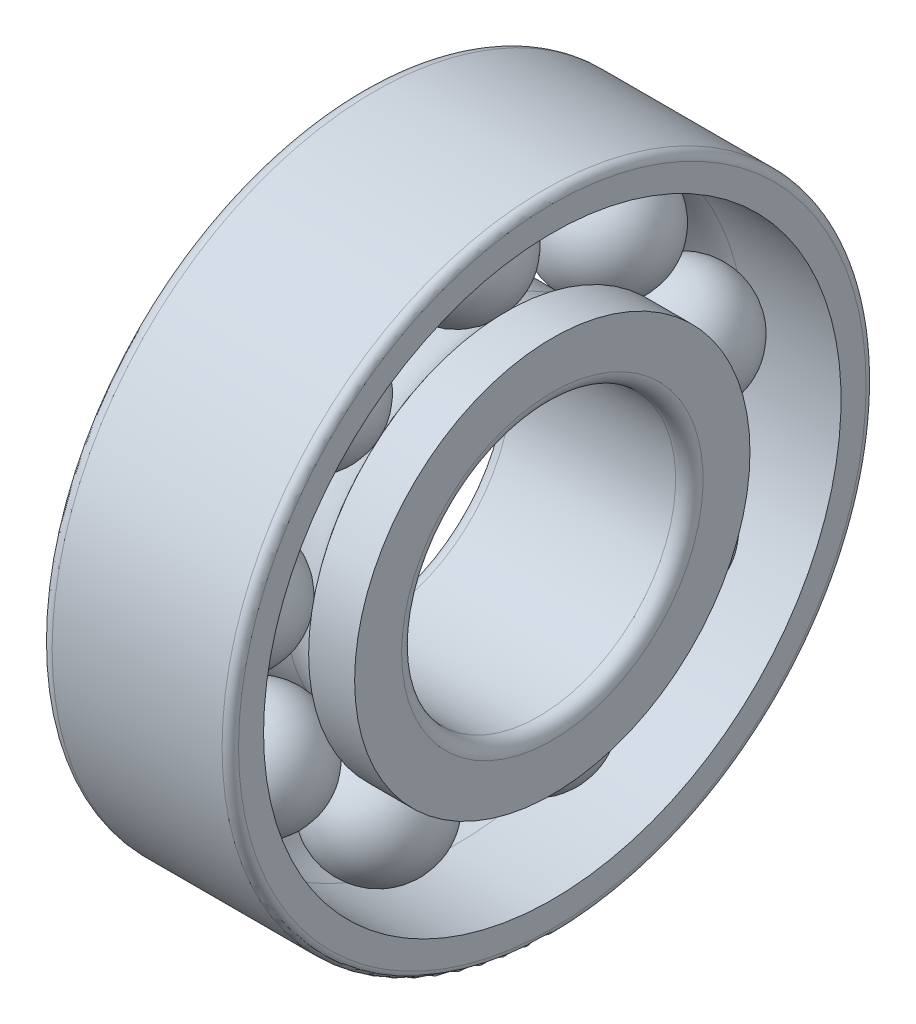
ISO-10303-21;
HEADER;
FILE_DESCRIPTION(('STEP AP214'),'2;1');
FILE_NAME('part.step','',(''),(''),'','','');
FILE_SCHEMA(('AUTOMOTIVE_DESIGN { 1 0 10303 214 1 1 1 1 }'));
ENDSEC;
DATA;
#1=APPLICATION_CONTEXT('core data for automotive mechanical design processes');
#2=APPLICATION_PROTOCOL_DEFINITION('international standard','automotive_design',2000,#1);
#3=PRODUCT_CONTEXT('',#1,'mechanical');
#4=PRODUCT('Part','Part','',(#3));
#5=PRODUCT_RELATED_PRODUCT_CATEGORY('part','',(#4));
#6=PRODUCT_DEFINITION_FORMATION('','',#4);
#7=PRODUCT_DEFINITION_CONTEXT('part definition',#1,'design');
#8=PRODUCT_DEFINITION('design','',#6,#7);
#9=PRODUCT_DEFINITION_SHAPE('','',#8);
#10=(LENGTH_UNIT() NAMED_UNIT(*) SI_UNIT(.MILLI.,.METRE.));
#11=(NAMED_UNIT(*) PLANE_ANGLE_UNIT() SI_UNIT($,.RADIAN.));
#12=(NAMED_UNIT(*) SI_UNIT($,.STERADIAN.) SOLID_ANGLE_UNIT());
#13=UNCERTAINTY_MEASURE_WITH_UNIT(LENGTH_MEASURE(1.E-05),#10,'distance_accuracy_value','');
#14=(GEOMETRIC_REPRESENTATION_CONTEXT(3) GLOBAL_UNCERTAINTY_ASSIGNED_CONTEXT((#13)) GLOBAL_UNIT_ASSIGNED_CONTEXT((#10,
#11,#12)) REPRESENTATION_CONTEXT('',''));
#15=CARTESIAN_POINT('',(0.,0.,0.));
#16=DIRECTION('',(0.,0.,1.));
#17=DIRECTION('',(1.,0.,0.));
#18=AXIS2_PLACEMENT_3D('',#15,#16,#17);
#19=CARTESIAN_POINT('',(-7.00000000000001,23.5,0.));
#20=DIRECTION('',(1.,0.,0.));
#21=DIRECTION('',(0.,0.,-1.));
#22=AXIS2_PLACEMENT_3D('',#19,#20,#21);
#23=PLANE('',#22);
#24=CARTESIAN_POINT('',(-7.00000000000001,0.,0.));
#25=DIRECTION('',(1.,0.,0.));
#26=DIRECTION('',(0.,0.,-1.));
#27=AXIS2_PLACEMENT_3D('',#24,#25,#26);
#28=CIRCLE('',#27,22.5);
#29=CARTESIAN_POINT('',(-7.00000000000001,0.,-22.5));
#30=VERTEX_POINT('',#29);
#31=EDGE_CURVE('P0_E20',#30,#30,#28,.F.);
#32=ORIENTED_EDGE('',*,*,#31,.T.);
#33=EDGE_LOOP('',(#32));
#34=FACE_BOUND('',#33,.T.);
#35=CARTESIAN_POINT('',(-7.00000000000001,0.,0.));
#36=DIRECTION('',(-1.,0.,0.));
#37=DIRECTION('',(0.,0.,1.));
#38=AXIS2_PLACEMENT_3D('',#35,#36,#37);
#39=CIRCLE('',#38,19.074);
#40=CARTESIAN_POINT('',(-7.00000000000001,0.,19.074));
#41=VERTEX_POINT('',#40);
#42=EDGE_CURVE('P0_E33',#41,#41,#39,.T.);
#43=ORIENTED_EDGE('',*,*,#42,.F.);
#44=EDGE_LOOP('',(#43));
#45=FACE_BOUND('',#44,.T.);
#46=ADVANCED_FACE('P0_F14',(#34,#45),#23,.F.);
#47=CARTESIAN_POINT('',(0.,0.,0.));
#48=DIRECTION('',(-1.,0.,0.));
#49=DIRECTION('',(0.,0.,1.));
#50=AXIS2_PLACEMENT_3D('',#47,#48,#49);
#51=CYLINDRICAL_SURFACE('',#50,19.074);
#52=CARTESIAN_POINT('',(-3.64399615806603,0.,0.));
#53=DIRECTION('',(-1.,0.,0.));
#54=DIRECTION('',(0.,0.,1.));
#55=AXIS2_PLACEMENT_3D('',#52,#53,#54);
#56=CIRCLE('',#55,19.074);
#57=CARTESIAN_POINT('',(-3.64399615806603,0.,19.074));
#58=VERTEX_POINT('',#57);
#59=EDGE_CURVE('P0_E36',#58,#58,#56,.T.);
#60=ORIENTED_EDGE('',*,*,#59,.F.);
#61=EDGE_LOOP('',(#60));
#62=FACE_BOUND('',#61,.T.);
#63=ORIENTED_EDGE('',*,*,#42,.T.);
#64=EDGE_LOOP('',(#63));
#65=FACE_BOUND('',#64,.T.);
#66=ADVANCED_FACE('P0_F57',(#62,#65),#51,.F.);
#67=CARTESIAN_POINT('',(0.,0.,0.));
#68=DIRECTION('',(-1.,0.,0.));
#69=DIRECTION('',(0.,0.,1.));
#70=AXIS2_PLACEMENT_3D('',#67,#68,#69);
#71=TOROIDAL_SURFACE('',#70,16.75,4.322);
#72=CARTESIAN_POINT('',(0.,0.,0.));
#73=DIRECTION('',(-1.,0.,0.));
#74=DIRECTION('',(0.,0.,1.));
#75=AXIS2_PLACEMENT_3D('',#72,#73,#74);
#76=CIRCLE('',#75,21.072);
#77=CARTESIAN_POINT('',(0.,0.,21.072));
#78=VERTEX_POINT('',#77);
#79=EDGE_CURVE('P0_E39',#78,#78,#76,.T.);
#80=ORIENTED_EDGE('',*,*,#79,.F.);
#81=EDGE_LOOP('',(#80));
#82=FACE_BOUND('',#81,.T.);
#83=ORIENTED_EDGE('',*,*,#59,.T.);
#84=EDGE_LOOP('',(#83));
#85=FACE_BOUND('',#84,.T.);
#86=ADVANCED_FACE('P0_F51',(#82,#85),#71,.F.);
#87=CARTESIAN_POINT('',(0.,0.,0.));
#88=DIRECTION('',(-1.,0.,0.));
#89=DIRECTION('',(0.,0.,1.));
#90=AXIS2_PLACEMENT_3D('',#87,#88,#89);
#91=CYLINDRICAL_SURFACE('',#90,21.072);
#92=CARTESIAN_POINT('',(7.00000000000001,0.,0.));
#93=DIRECTION('',(-1.,0.,0.));
#94=DIRECTION('',(0.,0.,1.));
#95=AXIS2_PLACEMENT_3D('',#92,#93,#94);
#96=CIRCLE('',#95,21.072);
#97=CARTESIAN_POINT('',(7.00000000000001,0.,21.072));
#98=VERTEX_POINT('',#97);
#99=EDGE_CURVE('P0_E42',#98,#98,#96,.T.);
#100=ORIENTED_EDGE('',*,*,#99,.F.);
#101=EDGE_LOOP('',(#100));
#102=FACE_BOUND('',#101,.T.);
#103=ORIENTED_EDGE('',*,*,#79,.T.);
#104=EDGE_LOOP('',(#103));
#105=FACE_BOUND('',#104,.T.);
#106=ADVANCED_FACE('P0_F48',(#102,#105),#91,.F.);
#107=CARTESIAN_POINT('',(7.00000000000001,23.5,0.));
#108=DIRECTION('',(-1.,0.,0.));
#109=DIRECTION('',(0.,0.,1.));
#110=AXIS2_PLACEMENT_3D('',#107,#108,#109);
#111=PLANE('',#110);
#112=CARTESIAN_POINT('',(7.00000000000001,0.,0.));
#113=DIRECTION('',(-1.,0.,0.));
#114=DIRECTION('',(0.,0.,1.));
#115=AXIS2_PLACEMENT_3D('',#112,#113,#114);
#116=CIRCLE('',#115,22.9);
#117=CARTESIAN_POINT('',(7.00000000000001,0.,22.9));
#118=VERTEX_POINT('',#117);
#119=EDGE_CURVE('P0_E24',#118,#118,#116,.F.);
#120=ORIENTED_EDGE('',*,*,#119,.T.);
#121=EDGE_LOOP('',(#120));
#122=FACE_BOUND('',#121,.T.);
#123=ORIENTED_EDGE('',*,*,#99,.T.);
#124=EDGE_LOOP('',(#123));
#125=FACE_BOUND('',#124,.T.);
#126=ADVANCED_FACE('P0_F46',(#122,#125),#111,.F.);
#127=CARTESIAN_POINT('',(0.,0.,0.));
#128=DIRECTION('',(-1.,0.,0.));
#129=DIRECTION('',(0.,0.,1.));
#130=AXIS2_PLACEMENT_3D('',#127,#128,#129);
#131=CYLINDRICAL_SURFACE('',#130,23.5);
#132=CARTESIAN_POINT('',(-6.00000000000001,0.,0.));
#133=DIRECTION('',(1.,0.,0.));
#134=DIRECTION('',(0.,0.,-1.));
#135=AXIS2_PLACEMENT_3D('',#132,#133,#134);
#136=CIRCLE('',#135,23.5);
#137=CARTESIAN_POINT('',(-6.00000000000001,0.,-23.5));
#138=VERTEX_POINT('',#137);
#139=EDGE_CURVE('P0_E10',#138,#138,#136,.T.);
#140=ORIENTED_EDGE('',*,*,#139,.T.);
#141=EDGE_LOOP('',(#140));
#142=FACE_BOUND('',#141,.T.);
#143=CARTESIAN_POINT('',(6.4,0.,0.));
#144=DIRECTION('',(-1.,0.,0.));
#145=DIRECTION('',(0.,0.,1.));
#146=AXIS2_PLACEMENT_3D('',#143,#144,#145);
#147=CIRCLE('',#146,23.5);
#148=CARTESIAN_POINT('',(6.4,0.,23.5));
#149=VERTEX_POINT('',#148);
#150=EDGE_CURVE('P0_E28',#149,#149,#147,.T.);
#151=ORIENTED_EDGE('',*,*,#150,.T.);
#152=EDGE_LOOP('',(#151));
#153=FACE_BOUND('',#152,.T.);
#154=ADVANCED_FACE('P0_F93',(#142,#153),#131,.T.);
#155=CARTESIAN_POINT('',(6.4,0.,0.));
#156=DIRECTION('',(-1.,0.,0.));
#157=DIRECTION('',(0.,0.,1.));
#158=AXIS2_PLACEMENT_3D('',#155,#156,#157);
#159=TOROIDAL_SURFACE('',#158,22.9,0.6);
#160=ORIENTED_EDGE('',*,*,#119,.F.);
#161=EDGE_LOOP('',(#160));
#162=FACE_BOUND('',#161,.T.);
#163=ORIENTED_EDGE('',*,*,#150,.F.);
#164=EDGE_LOOP('',(#163));
#165=FACE_BOUND('',#164,.T.);
#166=ADVANCED_FACE('P0_F102',(#162,#165),#159,.T.);
#167=CARTESIAN_POINT('',(-6.00000000000001,0.,0.));
#168=DIRECTION('',(1.,0.,0.));
#169=DIRECTION('',(0.,0.,-1.));
#170=AXIS2_PLACEMENT_3D('',#167,#168,#169);
#171=TOROIDAL_SURFACE('',#170,22.5,1.);
#172=ORIENTED_EDGE('',*,*,#139,.F.);
#173=EDGE_LOOP('',(#172));
#174=FACE_BOUND('',#173,.T.);
#175=ORIENTED_EDGE('',*,*,#31,.F.);
#176=EDGE_LOOP('',(#175));
#177=FACE_BOUND('',#176,.T.);
#178=ADVANCED_FACE('P0_F110',(#174,#177),#171,.T.);
#179=CLOSED_SHELL('',(#46,#66,#86,#106,#126,#154,#166,#178));
#180=MANIFOLD_SOLID_BREP('P0_B1',#179);
#181=CARTESIAN_POINT('',(0.,12.8312444222432,-10.7666924622495));
#182=DIRECTION('',(-1.,0.,0.));
#183=DIRECTION('',(0.,0.766044443118998,-0.642787609686538));
#184=AXIS2_PLACEMENT_3D('',#181,#182,#183);
#185=SPHERICAL_SURFACE('',#184,4.322);
#186=CARTESIAN_POINT('',(-4.32199999999992,12.8312444222432,-10.7666924622495));
#187=VERTEX_POINT('',#186);
#188=VERTEX_LOOP('',#187);
#189=FACE_BOUND('',#188,.T.);
#190=ADVANCED_FACE('P1_F12',(#189),#185,.T.);
#191=CLOSED_SHELL('',(#190));
#192=MANIFOLD_SOLID_BREP('P1_B1',#191);
#193=CARTESIAN_POINT('',(0.,2.90860697592131,-16.4955298629546));
#194=DIRECTION('',(-1.,0.,0.));
#195=DIRECTION('',(0.,0.173648177666945,-0.98480775301222));
#196=AXIS2_PLACEMENT_3D('',#193,#194,#195);
#197=SPHERICAL_SURFACE('',#196,4.322);
#198=CARTESIAN_POINT('',(-4.32199999999992,2.90860697592131,-16.4955298629546));
#199=VERTEX_POINT('',#198);
#200=VERTEX_LOOP('',#199);
#201=FACE_BOUND('',#200,.T.);
#202=ADVANCED_FACE('P2_F12',(#201),#197,.T.);
#203=CLOSED_SHELL('',(#202));
#204=MANIFOLD_SOLID_BREP('P2_B1',#203);
#205=CARTESIAN_POINT('',(0.,-8.37499999999992,-14.5059255133896));
#206=DIRECTION('',(-1.,0.,0.));
#207=DIRECTION('',(0.,-0.499999999999998,-0.866025403784456));
#208=AXIS2_PLACEMENT_3D('',#205,#206,#207);
#209=SPHERICAL_SURFACE('',#208,4.322);
#210=CARTESIAN_POINT('',(-4.32199999999992,-8.37499999999992,-14.5059255133896));
#211=VERTEX_POINT('',#210);
#212=VERTEX_LOOP('',#211);
#213=FACE_BOUND('',#212,.T.);
#214=ADVANCED_FACE('P3_F12',(#213),#209,.T.);
#215=CLOSED_SHELL('',(#214));
#216=MANIFOLD_SOLID_BREP('P3_B1',#215);
#217=CARTESIAN_POINT('',(0.,-15.7398513981641,-5.72883740070515));
#218=DIRECTION('',(-1.,0.,0.));
#219=DIRECTION('',(0.,-0.939692620785919,-0.342020143325682));
#220=AXIS2_PLACEMENT_3D('',#217,#218,#219);
#221=SPHERICAL_SURFACE('',#220,4.322);
#222=CARTESIAN_POINT('',(-4.32199999999992,-15.7398513981641,-5.72883740070515));
#223=VERTEX_POINT('',#222);
#224=VERTEX_LOOP('',#223);
#225=FACE_BOUND('',#224,.T.);
#226=ADVANCED_FACE('P4_F12',(#225),#221,.T.);
#227=CLOSED_SHELL('',(#226));
#228=MANIFOLD_SOLID_BREP('P4_B1',#227);
#229=CARTESIAN_POINT('',(0.,-15.7398513981642,5.72883740070488));
#230=DIRECTION('',(-1.,0.,0.));
#231=DIRECTION('',(0.,-0.939692620785925,0.342020143325666));
#232=AXIS2_PLACEMENT_3D('',#229,#230,#231);
#233=SPHERICAL_SURFACE('',#232,4.322);
#234=CARTESIAN_POINT('',(-4.32199999999992,-15.7398513981642,5.72883740070488));
#235=VERTEX_POINT('',#234);
#236=VERTEX_LOOP('',#235);
#237=FACE_BOUND('',#236,.T.);
#238=ADVANCED_FACE('P5_F12',(#237),#233,.T.);
#239=CLOSED_SHELL('',(#238));
#240=MANIFOLD_SOLID_BREP('P5_B1',#239);
#241=CARTESIAN_POINT('',(0.,-8.37500000000017,14.5059255133894));
#242=DIRECTION('',(-1.,0.,0.));
#243=DIRECTION('',(0.,-0.500000000000013,0.866025403784448));
#244=AXIS2_PLACEMENT_3D('',#241,#242,#243);
#245=SPHERICAL_SURFACE('',#244,4.322);
#246=CARTESIAN_POINT('',(-4.32199999999992,-8.37500000000017,14.5059255133894));
#247=VERTEX_POINT('',#246);
#248=VERTEX_LOOP('',#247);
#249=FACE_BOUND('',#248,.T.);
#250=ADVANCED_FACE('P6_F12',(#249),#245,.T.);
#251=CLOSED_SHELL('',(#250));
#252=MANIFOLD_SOLID_BREP('P6_B1',#251);
#253=CARTESIAN_POINT('',(0.,2.90860697592103,16.4955298629547));
#254=DIRECTION('',(-1.,0.,0.));
#255=DIRECTION('',(0.,0.173648177666928,0.984807753012223));
#256=AXIS2_PLACEMENT_3D('',#253,#254,#255);
#257=SPHERICAL_SURFACE('',#256,4.322);
#258=CARTESIAN_POINT('',(-4.32199999999992,2.90860697592103,16.4955298629547));
#259=VERTEX_POINT('',#258);
#260=VERTEX_LOOP('',#259);
#261=FACE_BOUND('',#260,.T.);
#262=ADVANCED_FACE('P7_F12',(#261),#257,.T.);
#263=CLOSED_SHELL('',(#262));
#264=MANIFOLD_SOLID_BREP('P7_B1',#263);
#265=CARTESIAN_POINT('',(0.,12.831244422243,10.7666924622497));
#266=DIRECTION('',(-1.,0.,0.));
#267=DIRECTION('',(0.,0.766044443118987,0.642787609686551));
#268=AXIS2_PLACEMENT_3D('',#265,#266,#267);
#269=SPHERICAL_SURFACE('',#268,4.322);
#270=CARTESIAN_POINT('',(-4.32199999999992,12.831244422243,10.7666924622497));
#271=VERTEX_POINT('',#270);
#272=VERTEX_LOOP('',#271);
#273=FACE_BOUND('',#272,.T.);
#274=ADVANCED_FACE('P8_F12',(#273),#269,.T.);
#275=CLOSED_SHELL('',(#274));
#276=MANIFOLD_SOLID_BREP('P8_B1',#275);
#277=CARTESIAN_POINT('',(0.,16.7500000000002,0.));
#278=DIRECTION('',(-1.,0.,0.));
#279=DIRECTION('',(0.,1.00000000000001,0.));
#280=AXIS2_PLACEMENT_3D('',#277,#278,#279);
#281=SPHERICAL_SURFACE('',#280,4.322);
#282=CARTESIAN_POINT('',(-4.32199999999992,16.7500000000002,0.));
#283=VERTEX_POINT('',#282);
#284=VERTEX_LOOP('',#283);
#285=FACE_BOUND('',#284,.T.);
#286=ADVANCED_FACE('P9_F12',(#285),#281,.T.);
#287=CLOSED_SHELL('',(#286));
#288=MANIFOLD_SOLID_BREP('P9_B1',#287);
#289=CARTESIAN_POINT('',(0.,0.,0.));
#290=DIRECTION('',(-1.,0.,0.));
#291=DIRECTION('',(0.,0.,1.));
#292=AXIS2_PLACEMENT_3D('',#289,#290,#291);
#293=CYLINDRICAL_SURFACE('',#292,10.);
#294=CARTESIAN_POINT('',(-6.00000000000001,0.,0.));
#295=DIRECTION('',(1.,0.,0.));
#296=DIRECTION('',(0.,0.,-1.));
#297=AXIS2_PLACEMENT_3D('',#294,#295,#296);
#298=CIRCLE('',#297,10.);
#299=CARTESIAN_POINT('',(-6.00000000000001,0.,-10.));
#300=VERTEX_POINT('',#299);
#301=EDGE_CURVE('P10_E24',#300,#300,#298,.F.);
#302=ORIENTED_EDGE('',*,*,#301,.T.);
#303=EDGE_LOOP('',(#302));
#304=FACE_BOUND('',#303,.T.);
#305=CARTESIAN_POINT('',(6.00000000000001,0.,0.));
#306=DIRECTION('',(-1.,0.,0.));
#307=DIRECTION('',(0.,0.,1.));
#308=AXIS2_PLACEMENT_3D('',#305,#306,#307);
#309=CIRCLE('',#308,10.);
#310=CARTESIAN_POINT('',(6.00000000000001,0.,10.));
#311=VERTEX_POINT('',#310);
#312=EDGE_CURVE('P10_E28',#311,#311,#309,.F.);
#313=ORIENTED_EDGE('',*,*,#312,.T.);
#314=EDGE_LOOP('',(#313));
#315=FACE_BOUND('',#314,.T.);
#316=ADVANCED_FACE('P10_F14',(#304,#315),#293,.F.);
#317=CARTESIAN_POINT('',(7.00000000000001,14.426,0.));
#318=DIRECTION('',(-1.,0.,0.));
#319=DIRECTION('',(0.,0.,1.));
#320=AXIS2_PLACEMENT_3D('',#317,#318,#319);
#321=PLANE('',#320);
#322=CARTESIAN_POINT('',(7.00000000000001,0.,0.));
#323=DIRECTION('',(-1.,0.,0.));
#324=DIRECTION('',(0.,0.,1.));
#325=AXIS2_PLACEMENT_3D('',#322,#323,#324);
#326=CIRCLE('',#325,11.);
#327=CARTESIAN_POINT('',(7.00000000000001,0.,11.));
#328=VERTEX_POINT('',#327);
#329=EDGE_CURVE('P10_E10',#328,#328,#326,.T.);
#330=ORIENTED_EDGE('',*,*,#329,.T.);
#331=EDGE_LOOP('',(#330));
#332=FACE_BOUND('',#331,.T.);
#333=CARTESIAN_POINT('',(7.00000000000001,0.,0.));
#334=DIRECTION('',(-1.,0.,0.));
#335=DIRECTION('',(0.,0.,1.));
#336=AXIS2_PLACEMENT_3D('',#333,#334,#335);
#337=CIRCLE('',#336,14.426);
#338=CARTESIAN_POINT('',(7.00000000000001,0.,14.426));
#339=VERTEX_POINT('',#338);
#340=EDGE_CURVE('P10_E33',#339,#339,#337,.T.);
#341=ORIENTED_EDGE('',*,*,#340,.F.);
#342=EDGE_LOOP('',(#341));
#343=FACE_BOUND('',#342,.T.);
#344=ADVANCED_FACE('P10_F63',(#332,#343),#321,.F.);
#345=CARTESIAN_POINT('',(0.,0.,0.));
#346=DIRECTION('',(-1.,0.,0.));
#347=DIRECTION('',(0.,0.,1.));
#348=AXIS2_PLACEMENT_3D('',#345,#346,#347);
#349=CYLINDRICAL_SURFACE('',#348,14.426);
#350=CARTESIAN_POINT('',(3.64399615806603,0.,0.));
#351=DIRECTION('',(-1.,0.,0.));
#352=DIRECTION('',(0.,0.,1.));
#353=AXIS2_PLACEMENT_3D('',#350,#351,#352);
#354=CIRCLE('',#353,14.426);
#355=CARTESIAN_POINT('',(3.64399615806603,0.,14.426));
#356=VERTEX_POINT('',#355);
#357=EDGE_CURVE('P10_E36',#356,#356,#354,.T.);
#358=ORIENTED_EDGE('',*,*,#357,.F.);
#359=EDGE_LOOP('',(#358));
#360=FACE_BOUND('',#359,.T.);
#361=ORIENTED_EDGE('',*,*,#340,.T.);
#362=EDGE_LOOP('',(#361));
#363=FACE_BOUND('',#362,.T.);
#364=ADVANCED_FACE('P10_F57',(#360,#363),#349,.T.);
#365=CARTESIAN_POINT('',(0.,0.,0.));
#366=DIRECTION('',(-1.,0.,0.));
#367=DIRECTION('',(0.,0.,1.));
#368=AXIS2_PLACEMENT_3D('',#365,#366,#367);
#369=TOROIDAL_SURFACE('',#368,16.75,4.322);
#370=CARTESIAN_POINT('',(0.,0.,0.));
#371=DIRECTION('',(-1.,0.,0.));
#372=DIRECTION('',(0.,0.,1.));
#373=AXIS2_PLACEMENT_3D('',#370,#371,#372);
#374=CIRCLE('',#373,12.428);
#375=CARTESIAN_POINT('',(0.,0.,12.428));
#376=VERTEX_POINT('',#375);
#377=EDGE_CURVE('P10_E39',#376,#376,#374,.T.);
#378=ORIENTED_EDGE('',*,*,#377,.F.);
#379=EDGE_LOOP('',(#378));
#380=FACE_BOUND('',#379,.T.);
#381=ORIENTED_EDGE('',*,*,#357,.T.);
#382=EDGE_LOOP('',(#381));
#383=FACE_BOUND('',#382,.T.);
#384=ADVANCED_FACE('P10_F51',(#380,#383),#369,.F.);
#385=CARTESIAN_POINT('',(0.,0.,0.));
#386=DIRECTION('',(-1.,0.,0.));
#387=DIRECTION('',(0.,0.,1.));
#388=AXIS2_PLACEMENT_3D('',#385,#386,#387);
#389=CYLINDRICAL_SURFACE('',#388,12.428);
#390=CARTESIAN_POINT('',(-7.,0.,0.));
#391=DIRECTION('',(-1.,0.,0.));
#392=DIRECTION('',(0.,0.,1.));
#393=AXIS2_PLACEMENT_3D('',#390,#391,#392);
#394=CIRCLE('',#393,12.428);
#395=CARTESIAN_POINT('',(-7.,0.,12.428));
#396=VERTEX_POINT('',#395);
#397=EDGE_CURVE('P10_E42',#396,#396,#394,.T.);
#398=ORIENTED_EDGE('',*,*,#397,.F.);
#399=EDGE_LOOP('',(#398));
#400=FACE_BOUND('',#399,.T.);
#401=ORIENTED_EDGE('',*,*,#377,.T.);
#402=EDGE_LOOP('',(#401));
#403=FACE_BOUND('',#402,.T.);
#404=ADVANCED_FACE('P10_F48',(#400,#403),#389,.T.);
#405=CARTESIAN_POINT('',(-7.,12.428,0.));
#406=DIRECTION('',(1.,0.,0.));
#407=DIRECTION('',(0.,0.,-1.));
#408=AXIS2_PLACEMENT_3D('',#405,#406,#407);
#409=PLANE('',#408);
#410=CARTESIAN_POINT('',(-7.,0.,0.));
#411=DIRECTION('',(1.,0.,0.));
#412=DIRECTION('',(0.,0.,-1.));
#413=AXIS2_PLACEMENT_3D('',#410,#411,#412);
#414=CIRCLE('',#413,11.);
#415=CARTESIAN_POINT('',(-7.,0.,-11.));
#416=VERTEX_POINT('',#415);
#417=EDGE_CURVE('P10_E20',#416,#416,#414,.T.);
#418=ORIENTED_EDGE('',*,*,#417,.T.);
#419=EDGE_LOOP('',(#418));
#420=FACE_BOUND('',#419,.T.);
#421=ORIENTED_EDGE('',*,*,#397,.T.);
#422=EDGE_LOOP('',(#421));
#423=FACE_BOUND('',#422,.T.);
#424=ADVANCED_FACE('P10_F46',(#420,#423),#409,.F.);
#425=CARTESIAN_POINT('',(-6.00000000000001,0.,0.));
#426=DIRECTION('',(1.,0.,0.));
#427=DIRECTION('',(0.,0.,-1.));
#428=AXIS2_PLACEMENT_3D('',#425,#426,#427);
#429=TOROIDAL_SURFACE('',#428,11.,1.);
#430=ORIENTED_EDGE('',*,*,#417,.F.);
#431=EDGE_LOOP('',(#430));
#432=FACE_BOUND('',#431,.T.);
#433=ORIENTED_EDGE('',*,*,#301,.F.);
#434=EDGE_LOOP('',(#433));
#435=FACE_BOUND('',#434,.T.);
#436=ADVANCED_FACE('P10_F76',(#432,#435),#429,.T.);
#437=CARTESIAN_POINT('',(6.00000000000001,0.,0.));
#438=DIRECTION('',(-1.,0.,0.));
#439=DIRECTION('',(0.,0.,1.));
#440=AXIS2_PLACEMENT_3D('',#437,#438,#439);
#441=TOROIDAL_SURFACE('',#440,11.,1.);
#442=ORIENTED_EDGE('',*,*,#312,.F.);
#443=EDGE_LOOP('',(#442));
#444=FACE_BOUND('',#443,.T.);
#445=ORIENTED_EDGE('',*,*,#329,.F.);
#446=EDGE_LOOP('',(#445));
#447=FACE_BOUND('',#446,.T.);
#448=ADVANCED_FACE('P10_F79',(#444,#447),#441,.T.);
#449=CLOSED_SHELL('',(#316,#344,#364,#384,#404,#424,#436,#448));
#450=MANIFOLD_SOLID_BREP('P10_B1',#449);
#451=ADVANCED_BREP_SHAPE_REPRESENTATION('',(#18,#180,#192,#204,#216,#228,#240,#252,#264,#276,
#288,#450),#14);
#452=SHAPE_DEFINITION_REPRESENTATION(#9,#451);
ENDSEC;
END-ISO-10303-21;
